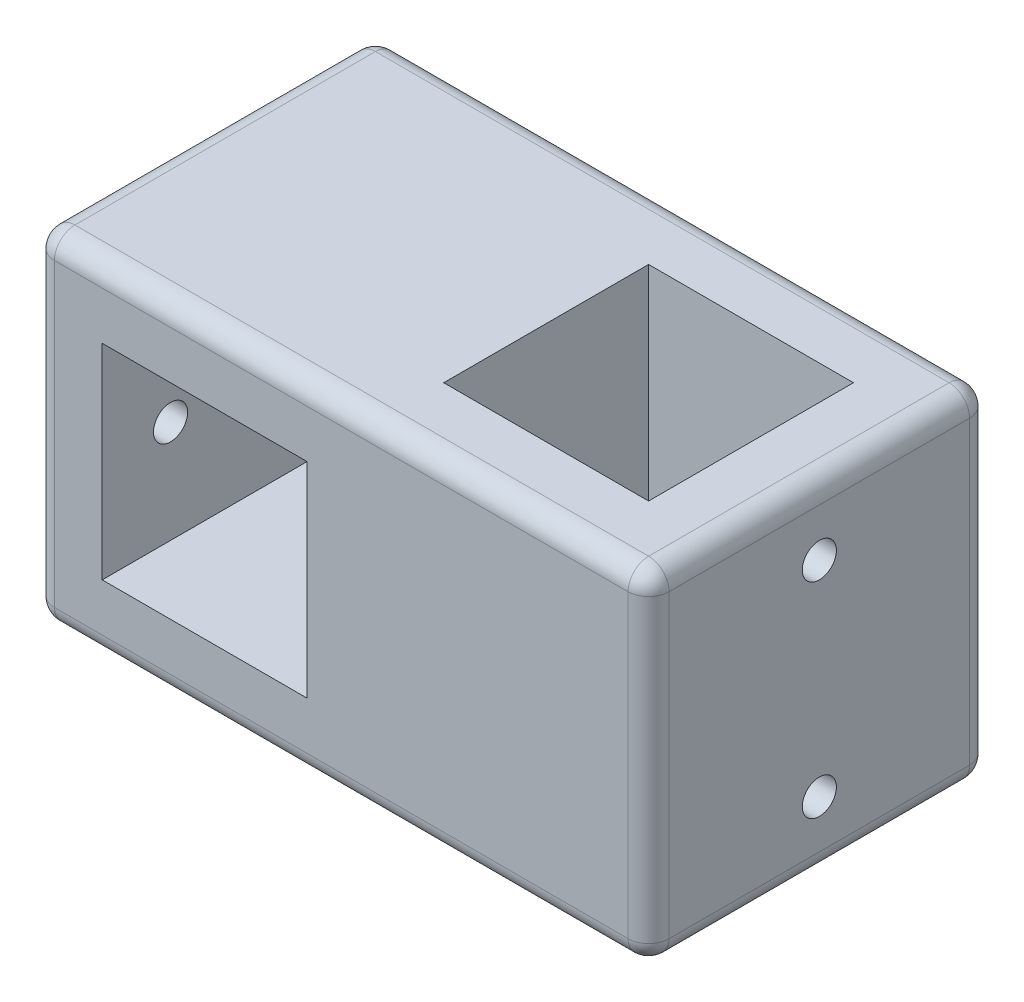
ISO-10303-21;
HEADER;
FILE_DESCRIPTION(('STEP AP214'),'2;1');
FILE_NAME('part.step','',(''),(''),'','','');
FILE_SCHEMA(('AUTOMOTIVE_DESIGN { 1 0 10303 214 1 1 1 1 }'));
ENDSEC;
DATA;
#1=APPLICATION_CONTEXT('core data for automotive mechanical design processes');
#2=APPLICATION_PROTOCOL_DEFINITION('international standard','automotive_design',2000,#1);
#3=PRODUCT_CONTEXT('',#1,'mechanical');
#4=PRODUCT('Part','Part','',(#3));
#5=PRODUCT_RELATED_PRODUCT_CATEGORY('part','',(#4));
#6=PRODUCT_DEFINITION_FORMATION('','',#4);
#7=PRODUCT_DEFINITION_CONTEXT('part definition',#1,'design');
#8=PRODUCT_DEFINITION('design','',#6,#7);
#9=PRODUCT_DEFINITION_SHAPE('','',#8);
#10=(LENGTH_UNIT() NAMED_UNIT(*) SI_UNIT(.MILLI.,.METRE.));
#11=(NAMED_UNIT(*) PLANE_ANGLE_UNIT() SI_UNIT($,.RADIAN.));
#12=(NAMED_UNIT(*) SI_UNIT($,.STERADIAN.) SOLID_ANGLE_UNIT());
#13=UNCERTAINTY_MEASURE_WITH_UNIT(LENGTH_MEASURE(1.E-05),#10,'distance_accuracy_value','');
#14=(GEOMETRIC_REPRESENTATION_CONTEXT(3) GLOBAL_UNCERTAINTY_ASSIGNED_CONTEXT((#13)) GLOBAL_UNIT_ASSIGNED_CONTEXT((#10,
#11,#12)) REPRESENTATION_CONTEXT('',''));
#15=CARTESIAN_POINT('',(0.,0.,0.));
#16=DIRECTION('',(0.,0.,1.));
#17=DIRECTION('',(1.,0.,0.));
#18=AXIS2_PLACEMENT_3D('',#15,#16,#17);
#19=CARTESIAN_POINT('',(-45.,-25.,50.));
#20=DIRECTION('',(1.,0.,0.));
#21=DIRECTION('',(0.,0.,-1.));
#22=AXIS2_PLACEMENT_3D('',#19,#20,#21);
#23=PLANE('',#22);
#24=CARTESIAN_POINT('',(-45.,0.,10.));
#25=DIRECTION('',(-1.,0.,0.));
#26=DIRECTION('',(0.,0.,1.));
#27=AXIS2_PLACEMENT_3D('',#24,#25,#26);
#28=CIRCLE('',#27,2.5);
#29=CARTESIAN_POINT('',(-45.,0.,12.5));
#30=VERTEX_POINT('',#29);
#31=EDGE_CURVE('E449',#30,#30,#28,.T.);
#32=ORIENTED_EDGE('',*,*,#31,.F.);
#33=EDGE_LOOP('',(#32));
#34=FACE_BOUND('',#33,.T.);
#35=CARTESIAN_POINT('',(-45.,0.,40.));
#36=DIRECTION('',(-1.,0.,0.));
#37=DIRECTION('',(0.,0.,1.));
#38=AXIS2_PLACEMENT_3D('',#35,#36,#37);
#39=CIRCLE('',#38,2.5);
#40=CARTESIAN_POINT('',(-45.,0.,42.5));
#41=VERTEX_POINT('',#40);
#42=EDGE_CURVE('E450',#41,#41,#39,.T.);
#43=ORIENTED_EDGE('',*,*,#42,.F.);
#44=EDGE_LOOP('',(#43));
#45=FACE_BOUND('',#44,.T.);
#46=DIRECTION('',(0.,0.,-1.));
#47=VECTOR('',#46,1.);
#48=CARTESIAN_POINT('',(-45.,-22.,50.));
#49=LINE('',#48,#47);
#50=CARTESIAN_POINT('',(-45.,-22.,3.));
#51=VERTEX_POINT('',#50);
#52=CARTESIAN_POINT('',(-45.,-22.,47.));
#53=VERTEX_POINT('',#52);
#54=EDGE_CURVE('E276',#51,#53,#49,.F.);
#55=ORIENTED_EDGE('',*,*,#54,.T.);
#56=DIRECTION('',(0.,-1.,0.));
#57=VECTOR('',#56,1.);
#58=CARTESIAN_POINT('',(-45.,25.,47.));
#59=LINE('',#58,#57);
#60=CARTESIAN_POINT('',(-45.,22.,47.));
#61=VERTEX_POINT('',#60);
#62=EDGE_CURVE('E283',#53,#61,#59,.F.);
#63=ORIENTED_EDGE('',*,*,#62,.T.);
#64=DIRECTION('',(0.,0.,-1.));
#65=VECTOR('',#64,1.);
#66=CARTESIAN_POINT('',(-45.,22.,50.));
#67=LINE('',#66,#65);
#68=CARTESIAN_POINT('',(-45.,22.,3.));
#69=VERTEX_POINT('',#68);
#70=EDGE_CURVE('E279',#61,#69,#67,.T.);
#71=ORIENTED_EDGE('',*,*,#70,.T.);
#72=DIRECTION('',(0.,-1.,0.));
#73=VECTOR('',#72,1.);
#74=CARTESIAN_POINT('',(-45.,-25.,3.));
#75=LINE('',#74,#73);
#76=EDGE_CURVE('E273',#69,#51,#75,.T.);
#77=ORIENTED_EDGE('',*,*,#76,.T.);
#78=EDGE_LOOP('',(#55,#63,#71,#77));
#79=FACE_BOUND('',#78,.T.);
#80=ADVANCED_FACE('F39',(#34,#45,#79),#23,.F.);
#81=CARTESIAN_POINT('',(45.,-25.,50.));
#82=DIRECTION('',(0.,1.,0.));
#83=DIRECTION('',(-1.,0.,0.));
#84=AXIS2_PLACEMENT_3D('',#81,#82,#83);
#85=PLANE('',#84);
#86=DIRECTION('',(1.,0.,0.));
#87=VECTOR('',#86,1.);
#88=CARTESIAN_POINT('',(-45.,-25.,47.));
#89=LINE('',#88,#87);
#90=CARTESIAN_POINT('',(42.,-25.,47.));
#91=VERTEX_POINT('',#90);
#92=CARTESIAN_POINT('',(-42.,-25.,47.));
#93=VERTEX_POINT('',#92);
#94=EDGE_CURVE('E302',#91,#93,#89,.F.);
#95=ORIENTED_EDGE('',*,*,#94,.T.);
#96=DIRECTION('',(0.,0.,-1.));
#97=VECTOR('',#96,1.);
#98=CARTESIAN_POINT('',(-42.,-25.,50.));
#99=LINE('',#98,#97);
#100=CARTESIAN_POINT('',(-42.,-25.,3.));
#101=VERTEX_POINT('',#100);
#102=EDGE_CURVE('E308',#93,#101,#99,.T.);
#103=ORIENTED_EDGE('',*,*,#102,.T.);
#104=DIRECTION('',(1.,0.,0.));
#105=VECTOR('',#104,1.);
#106=CARTESIAN_POINT('',(45.,-25.,3.));
#107=LINE('',#106,#105);
#108=CARTESIAN_POINT('',(42.,-25.,3.));
#109=VERTEX_POINT('',#108);
#110=EDGE_CURVE('E305',#101,#109,#107,.T.);
#111=ORIENTED_EDGE('',*,*,#110,.T.);
#112=DIRECTION('',(0.,0.,-1.));
#113=VECTOR('',#112,1.);
#114=CARTESIAN_POINT('',(42.,-25.,50.));
#115=LINE('',#114,#113);
#116=EDGE_CURVE('E299',#109,#91,#115,.F.);
#117=ORIENTED_EDGE('',*,*,#116,.T.);
#118=EDGE_LOOP('',(#95,#103,#111,#117));
#119=FACE_BOUND('',#118,.T.);
#120=DIRECTION('',(1.,0.,0.));
#121=VECTOR('',#120,1.);
#122=CARTESIAN_POINT('',(35.,-25.,9.99999999999999));
#123=LINE('',#122,#121);
#124=CARTESIAN_POINT('',(5.,-25.,10.));
#125=VERTEX_POINT('',#124);
#126=CARTESIAN_POINT('',(35.,-25.,9.99999999999999));
#127=VERTEX_POINT('',#126);
#128=EDGE_CURVE('E204',#125,#127,#123,.T.);
#129=ORIENTED_EDGE('',*,*,#128,.F.);
#130=DIRECTION('',(0.,0.,-1.));
#131=VECTOR('',#130,1.);
#132=CARTESIAN_POINT('',(5.,-25.,10.));
#133=LINE('',#132,#131);
#134=CARTESIAN_POINT('',(5.,-25.,40.));
#135=VERTEX_POINT('',#134);
#136=EDGE_CURVE('E181',#135,#125,#133,.T.);
#137=ORIENTED_EDGE('',*,*,#136,.F.);
#138=DIRECTION('',(-1.,0.,0.));
#139=VECTOR('',#138,1.);
#140=CARTESIAN_POINT('',(35.,-25.,40.));
#141=LINE('',#140,#139);
#142=CARTESIAN_POINT('',(35.,-25.,40.));
#143=VERTEX_POINT('',#142);
#144=EDGE_CURVE('E194',#143,#135,#141,.T.);
#145=ORIENTED_EDGE('',*,*,#144,.F.);
#146=DIRECTION('',(0.,0.,1.));
#147=VECTOR('',#146,1.);
#148=CARTESIAN_POINT('',(35.,-25.,9.99999999999999));
#149=LINE('',#148,#147);
#150=EDGE_CURVE('E211',#127,#143,#149,.T.);
#151=ORIENTED_EDGE('',*,*,#150,.F.);
#152=EDGE_LOOP('',(#129,#137,#145,#151));
#153=FACE_BOUND('',#152,.T.);
#154=ADVANCED_FACE('F202',(#119,#153),#85,.F.);
#155=CARTESIAN_POINT('',(45.,-25.,50.));
#156=DIRECTION('',(-1.,0.,0.));
#157=DIRECTION('',(0.,0.,1.));
#158=AXIS2_PLACEMENT_3D('',#155,#156,#157);
#159=PLANE('',#158);
#160=CARTESIAN_POINT('',(45.,15.,25.));
#161=DIRECTION('',(1.,0.,0.));
#162=DIRECTION('',(0.,0.,-1.));
#163=AXIS2_PLACEMENT_3D('',#160,#161,#162);
#164=CIRCLE('',#163,2.5);
#165=CARTESIAN_POINT('',(45.,15.,22.5));
#166=VERTEX_POINT('',#165);
#167=EDGE_CURVE('E454',#166,#166,#164,.T.);
#168=ORIENTED_EDGE('',*,*,#167,.F.);
#169=EDGE_LOOP('',(#168));
#170=FACE_BOUND('',#169,.T.);
#171=CARTESIAN_POINT('',(45.,-15.,25.));
#172=DIRECTION('',(1.,0.,0.));
#173=DIRECTION('',(0.,0.,-1.));
#174=AXIS2_PLACEMENT_3D('',#171,#172,#173);
#175=CIRCLE('',#174,2.5);
#176=CARTESIAN_POINT('',(45.,-15.,22.5));
#177=VERTEX_POINT('',#176);
#178=EDGE_CURVE('E461',#177,#177,#175,.T.);
#179=ORIENTED_EDGE('',*,*,#178,.F.);
#180=EDGE_LOOP('',(#179));
#181=FACE_BOUND('',#180,.T.);
#182=DIRECTION('',(0.,0.,-1.));
#183=VECTOR('',#182,1.);
#184=CARTESIAN_POINT('',(45.,-22.,50.));
#185=LINE('',#184,#183);
#186=CARTESIAN_POINT('',(45.,-22.,47.));
#187=VERTEX_POINT('',#186);
#188=CARTESIAN_POINT('',(45.,-22.,3.));
#189=VERTEX_POINT('',#188);
#190=EDGE_CURVE('E49',#187,#189,#185,.T.);
#191=ORIENTED_EDGE('',*,*,#190,.T.);
#192=DIRECTION('',(0.,1.,0.));
#193=VECTOR('',#192,1.);
#194=CARTESIAN_POINT('',(45.,-25.,3.));
#195=LINE('',#194,#193);
#196=CARTESIAN_POINT('',(45.,22.,3.));
#197=VERTEX_POINT('',#196);
#198=EDGE_CURVE('E11',#189,#197,#195,.T.);
#199=ORIENTED_EDGE('',*,*,#198,.T.);
#200=DIRECTION('',(0.,0.,-1.));
#201=VECTOR('',#200,1.);
#202=CARTESIAN_POINT('',(45.,22.,50.));
#203=LINE('',#202,#201);
#204=CARTESIAN_POINT('',(45.,22.,47.));
#205=VERTEX_POINT('',#204);
#206=EDGE_CURVE('E341',#197,#205,#203,.F.);
#207=ORIENTED_EDGE('',*,*,#206,.T.);
#208=DIRECTION('',(0.,1.,0.));
#209=VECTOR('',#208,1.);
#210=CARTESIAN_POINT('',(45.,-25.,47.));
#211=LINE('',#210,#209);
#212=EDGE_CURVE('E338',#205,#187,#211,.F.);
#213=ORIENTED_EDGE('',*,*,#212,.T.);
#214=EDGE_LOOP('',(#191,#199,#207,#213));
#215=FACE_BOUND('',#214,.T.);
#216=ADVANCED_FACE('F506',(#170,#181,#215),#159,.F.);
#217=CARTESIAN_POINT('',(45.,25.,50.));
#218=DIRECTION('',(0.,-1.,0.));
#219=DIRECTION('',(1.,0.,0.));
#220=AXIS2_PLACEMENT_3D('',#217,#218,#219);
#221=PLANE('',#220);
#222=DIRECTION('',(0.,0.,-1.));
#223=VECTOR('',#222,1.);
#224=CARTESIAN_POINT('',(-42.,25.,50.));
#225=LINE('',#224,#223);
#226=CARTESIAN_POINT('',(-42.,25.,3.));
#227=VERTEX_POINT('',#226);
#228=CARTESIAN_POINT('',(-42.,25.,47.));
#229=VERTEX_POINT('',#228);
#230=EDGE_CURVE('E292',#227,#229,#225,.F.);
#231=ORIENTED_EDGE('',*,*,#230,.T.);
#232=DIRECTION('',(-1.,0.,0.));
#233=VECTOR('',#232,1.);
#234=CARTESIAN_POINT('',(45.,25.,47.));
#235=LINE('',#234,#233);
#236=CARTESIAN_POINT('',(42.,25.,47.));
#237=VERTEX_POINT('',#236);
#238=EDGE_CURVE('E296',#229,#237,#235,.F.);
#239=ORIENTED_EDGE('',*,*,#238,.T.);
#240=DIRECTION('',(0.,0.,-1.));
#241=VECTOR('',#240,1.);
#242=CARTESIAN_POINT('',(42.,25.,50.));
#243=LINE('',#242,#241);
#244=CARTESIAN_POINT('',(42.,25.,3.));
#245=VERTEX_POINT('',#244);
#246=EDGE_CURVE('E289',#237,#245,#243,.T.);
#247=ORIENTED_EDGE('',*,*,#246,.T.);
#248=DIRECTION('',(-1.,0.,0.));
#249=VECTOR('',#248,1.);
#250=CARTESIAN_POINT('',(45.,25.,3.));
#251=LINE('',#250,#249);
#252=EDGE_CURVE('E286',#245,#227,#251,.T.);
#253=ORIENTED_EDGE('',*,*,#252,.T.);
#254=EDGE_LOOP('',(#231,#239,#247,#253));
#255=FACE_BOUND('',#254,.T.);
#256=DIRECTION('',(1.,0.,0.));
#257=VECTOR('',#256,1.);
#258=CARTESIAN_POINT('',(35.,25.,40.));
#259=LINE('',#258,#257);
#260=CARTESIAN_POINT('',(5.,25.,40.));
#261=VERTEX_POINT('',#260);
#262=CARTESIAN_POINT('',(35.,25.,40.));
#263=VERTEX_POINT('',#262);
#264=EDGE_CURVE('E209',#261,#263,#259,.T.);
#265=ORIENTED_EDGE('',*,*,#264,.F.);
#266=DIRECTION('',(0.,0.,1.));
#267=VECTOR('',#266,1.);
#268=CARTESIAN_POINT('',(4.99999999999999,25.,10.));
#269=LINE('',#268,#267);
#270=CARTESIAN_POINT('',(4.99999999999999,25.,10.));
#271=VERTEX_POINT('',#270);
#272=EDGE_CURVE('E184',#271,#261,#269,.T.);
#273=ORIENTED_EDGE('',*,*,#272,.F.);
#274=DIRECTION('',(-1.,0.,0.));
#275=VECTOR('',#274,1.);
#276=CARTESIAN_POINT('',(35.,25.,9.99999999999999));
#277=LINE('',#276,#275);
#278=CARTESIAN_POINT('',(35.,25.,9.99999999999999));
#279=VERTEX_POINT('',#278);
#280=EDGE_CURVE('E190',#279,#271,#277,.T.);
#281=ORIENTED_EDGE('',*,*,#280,.F.);
#282=DIRECTION('',(0.,0.,-1.));
#283=VECTOR('',#282,1.);
#284=CARTESIAN_POINT('',(35.,25.,9.99999999999999));
#285=LINE('',#284,#283);
#286=EDGE_CURVE('E217',#263,#279,#285,.T.);
#287=ORIENTED_EDGE('',*,*,#286,.F.);
#288=EDGE_LOOP('',(#265,#273,#281,#287));
#289=FACE_BOUND('',#288,.T.);
#290=ADVANCED_FACE('F632',(#255,#289),#221,.F.);
#291=CARTESIAN_POINT('',(0.,0.,50.));
#292=DIRECTION('',(0.,0.,1.));
#293=DIRECTION('',(1.,0.,0.));
#294=AXIS2_PLACEMENT_3D('',#291,#292,#293);
#295=PLANE('',#294);
#296=DIRECTION('',(-1.,0.,0.));
#297=VECTOR('',#296,1.);
#298=CARTESIAN_POINT('',(-45.,22.,50.));
#299=LINE('',#298,#297);
#300=CARTESIAN_POINT('',(42.,22.,50.));
#301=VERTEX_POINT('',#300);
#302=CARTESIAN_POINT('',(-42.,22.,50.));
#303=VERTEX_POINT('',#302);
#304=EDGE_CURVE('E328',#301,#303,#299,.T.);
#305=ORIENTED_EDGE('',*,*,#304,.T.);
#306=DIRECTION('',(0.,-1.,0.));
#307=VECTOR('',#306,1.);
#308=CARTESIAN_POINT('',(-42.,-25.,50.));
#309=LINE('',#308,#307);
#310=CARTESIAN_POINT('',(-42.,-22.,50.));
#311=VERTEX_POINT('',#310);
#312=EDGE_CURVE('E335',#303,#311,#309,.T.);
#313=ORIENTED_EDGE('',*,*,#312,.T.);
#314=DIRECTION('',(1.,0.,0.));
#315=VECTOR('',#314,1.);
#316=CARTESIAN_POINT('',(45.,-22.,50.));
#317=LINE('',#316,#315);
#318=CARTESIAN_POINT('',(42.,-22.,50.));
#319=VERTEX_POINT('',#318);
#320=EDGE_CURVE('E331',#311,#319,#317,.T.);
#321=ORIENTED_EDGE('',*,*,#320,.T.);
#322=DIRECTION('',(0.,1.,0.));
#323=VECTOR('',#322,1.);
#324=CARTESIAN_POINT('',(42.,25.,50.));
#325=LINE('',#324,#323);
#326=EDGE_CURVE('E325',#319,#301,#325,.T.);
#327=ORIENTED_EDGE('',*,*,#326,.T.);
#328=EDGE_LOOP('',(#305,#313,#321,#327));
#329=FACE_BOUND('',#328,.T.);
#330=DIRECTION('',(0.,-1.,0.));
#331=VECTOR('',#330,1.);
#332=CARTESIAN_POINT('',(-35.,-15.,50.));
#333=LINE('',#332,#331);
#334=CARTESIAN_POINT('',(-35.,15.,50.));
#335=VERTEX_POINT('',#334);
#336=CARTESIAN_POINT('',(-35.,-15.,50.));
#337=VERTEX_POINT('',#336);
#338=EDGE_CURVE('E241',#335,#337,#333,.T.);
#339=ORIENTED_EDGE('',*,*,#338,.F.);
#340=DIRECTION('',(-1.,0.,0.));
#341=VECTOR('',#340,1.);
#342=CARTESIAN_POINT('',(-5.,15.,50.));
#343=LINE('',#342,#341);
#344=CARTESIAN_POINT('',(-5.,15.,50.));
#345=VERTEX_POINT('',#344);
#346=EDGE_CURVE('E252',#345,#335,#343,.T.);
#347=ORIENTED_EDGE('',*,*,#346,.F.);
#348=DIRECTION('',(0.,1.,0.));
#349=VECTOR('',#348,1.);
#350=CARTESIAN_POINT('',(-5.,-15.,50.));
#351=LINE('',#350,#349);
#352=CARTESIAN_POINT('',(-5.,-15.,50.));
#353=VERTEX_POINT('',#352);
#354=EDGE_CURVE('E248',#353,#345,#351,.T.);
#355=ORIENTED_EDGE('',*,*,#354,.F.);
#356=DIRECTION('',(1.,0.,0.));
#357=VECTOR('',#356,1.);
#358=CARTESIAN_POINT('',(-5.,-15.,50.));
#359=LINE('',#358,#357);
#360=EDGE_CURVE('E244',#337,#353,#359,.T.);
#361=ORIENTED_EDGE('',*,*,#360,.F.);
#362=EDGE_LOOP('',(#339,#347,#355,#361));
#363=FACE_BOUND('',#362,.T.);
#364=ADVANCED_FACE('F613',(#329,#363),#295,.T.);
#365=CARTESIAN_POINT('',(0.,0.,0.));
#366=DIRECTION('',(0.,0.,1.));
#367=DIRECTION('',(1.,0.,0.));
#368=AXIS2_PLACEMENT_3D('',#365,#366,#367);
#369=PLANE('',#368);
#370=DIRECTION('',(1.,0.,0.));
#371=VECTOR('',#370,1.);
#372=CARTESIAN_POINT('',(0.,-22.,0.));
#373=LINE('',#372,#371);
#374=CARTESIAN_POINT('',(42.,-22.,0.));
#375=VERTEX_POINT('',#374);
#376=CARTESIAN_POINT('',(-42.,-22.,0.));
#377=VERTEX_POINT('',#376);
#378=EDGE_CURVE('E318',#375,#377,#373,.F.);
#379=ORIENTED_EDGE('',*,*,#378,.T.);
#380=DIRECTION('',(0.,-1.,0.));
#381=VECTOR('',#380,1.);
#382=CARTESIAN_POINT('',(-42.,0.,0.));
#383=LINE('',#382,#381);
#384=CARTESIAN_POINT('',(-42.,22.,0.));
#385=VERTEX_POINT('',#384);
#386=EDGE_CURVE('E322',#377,#385,#383,.F.);
#387=ORIENTED_EDGE('',*,*,#386,.T.);
#388=DIRECTION('',(-1.,0.,0.));
#389=VECTOR('',#388,1.);
#390=CARTESIAN_POINT('',(0.,22.,0.));
#391=LINE('',#390,#389);
#392=CARTESIAN_POINT('',(42.,22.,0.));
#393=VERTEX_POINT('',#392);
#394=EDGE_CURVE('E315',#385,#393,#391,.F.);
#395=ORIENTED_EDGE('',*,*,#394,.T.);
#396=DIRECTION('',(0.,1.,0.));
#397=VECTOR('',#396,1.);
#398=CARTESIAN_POINT('',(42.,0.,0.));
#399=LINE('',#398,#397);
#400=EDGE_CURVE('E312',#393,#375,#399,.F.);
#401=ORIENTED_EDGE('',*,*,#400,.T.);
#402=EDGE_LOOP('',(#379,#387,#395,#401));
#403=FACE_BOUND('',#402,.T.);
#404=DIRECTION('',(1.,0.,0.));
#405=VECTOR('',#404,1.);
#406=CARTESIAN_POINT('',(-5.,15.,0.));
#407=LINE('',#406,#405);
#408=CARTESIAN_POINT('',(-35.,15.,0.));
#409=VERTEX_POINT('',#408);
#410=CARTESIAN_POINT('',(-5.,15.,0.));
#411=VERTEX_POINT('',#410);
#412=EDGE_CURVE('E233',#409,#411,#407,.T.);
#413=ORIENTED_EDGE('',*,*,#412,.F.);
#414=DIRECTION('',(0.,1.,0.));
#415=VECTOR('',#414,1.);
#416=CARTESIAN_POINT('',(-35.,-15.,0.));
#417=LINE('',#416,#415);
#418=CARTESIAN_POINT('',(-35.,-15.,0.));
#419=VERTEX_POINT('',#418);
#420=EDGE_CURVE('E237',#419,#409,#417,.T.);
#421=ORIENTED_EDGE('',*,*,#420,.F.);
#422=DIRECTION('',(-1.,0.,0.));
#423=VECTOR('',#422,1.);
#424=CARTESIAN_POINT('',(-5.,-15.,0.));
#425=LINE('',#424,#423);
#426=CARTESIAN_POINT('',(-5.,-15.,0.));
#427=VERTEX_POINT('',#426);
#428=EDGE_CURVE('E260',#427,#419,#425,.T.);
#429=ORIENTED_EDGE('',*,*,#428,.F.);
#430=DIRECTION('',(0.,-1.,0.));
#431=VECTOR('',#430,1.);
#432=CARTESIAN_POINT('',(-5.,-15.,0.));
#433=LINE('',#432,#431);
#434=EDGE_CURVE('E199',#411,#427,#433,.T.);
#435=ORIENTED_EDGE('',*,*,#434,.F.);
#436=EDGE_LOOP('',(#413,#421,#429,#435));
#437=FACE_BOUND('',#436,.T.);
#438=ADVANCED_FACE('F624',(#403,#437),#369,.F.);
#439=CARTESIAN_POINT('',(-35.,-15.,-0.001000000000001));
#440=DIRECTION('',(-1.,0.,0.));
#441=DIRECTION('',(0.,0.,1.));
#442=AXIS2_PLACEMENT_3D('',#439,#440,#441);
#443=PLANE('',#442);
#444=CARTESIAN_POINT('',(-35.,0.,10.));
#445=DIRECTION('',(-1.,0.,0.));
#446=DIRECTION('',(0.,0.,1.));
#447=AXIS2_PLACEMENT_3D('',#444,#445,#446);
#448=CIRCLE('',#447,2.5);
#449=CARTESIAN_POINT('',(-35.,0.,12.5));
#450=VERTEX_POINT('',#449);
#451=EDGE_CURVE('E350',#450,#450,#448,.F.);
#452=ORIENTED_EDGE('',*,*,#451,.F.);
#453=EDGE_LOOP('',(#452));
#454=FACE_BOUND('',#453,.T.);
#455=CARTESIAN_POINT('',(-35.,0.,40.));
#456=DIRECTION('',(-1.,0.,0.));
#457=DIRECTION('',(0.,0.,1.));
#458=AXIS2_PLACEMENT_3D('',#455,#456,#457);
#459=CIRCLE('',#458,2.5);
#460=CARTESIAN_POINT('',(-35.,0.,42.5));
#461=VERTEX_POINT('',#460);
#462=EDGE_CURVE('E445',#461,#461,#459,.F.);
#463=ORIENTED_EDGE('',*,*,#462,.F.);
#464=EDGE_LOOP('',(#463));
#465=FACE_BOUND('',#464,.T.);
#466=ORIENTED_EDGE('',*,*,#420,.T.);
#467=DIRECTION('',(0.,0.,1.));
#468=VECTOR('',#467,1.);
#469=CARTESIAN_POINT('',(-35.,15.,-0.001000000000001));
#470=LINE('',#469,#468);
#471=EDGE_CURVE('E257',#409,#335,#470,.T.);
#472=ORIENTED_EDGE('',*,*,#471,.T.);
#473=ORIENTED_EDGE('',*,*,#338,.T.);
#474=DIRECTION('',(0.,0.,1.));
#475=VECTOR('',#474,1.);
#476=CARTESIAN_POINT('',(-35.,-15.,-0.001000000000001));
#477=LINE('',#476,#475);
#478=EDGE_CURVE('E256',#419,#337,#477,.T.);
#479=ORIENTED_EDGE('',*,*,#478,.F.);
#480=EDGE_LOOP('',(#466,#472,#473,#479));
#481=FACE_BOUND('',#480,.T.);
#482=ADVANCED_FACE('F655',(#454,#465,#481),#443,.F.);
#483=CARTESIAN_POINT('',(-5.,15.,-0.001000000000001));
#484=DIRECTION('',(0.,1.,0.));
#485=DIRECTION('',(-1.,0.,0.));
#486=AXIS2_PLACEMENT_3D('',#483,#484,#485);
#487=PLANE('',#486);
#488=ORIENTED_EDGE('',*,*,#412,.T.);
#489=DIRECTION('',(0.,0.,1.));
#490=VECTOR('',#489,1.);
#491=CARTESIAN_POINT('',(-5.,15.,-0.001000000000001));
#492=LINE('',#491,#490);
#493=EDGE_CURVE('E261',#411,#345,#492,.T.);
#494=ORIENTED_EDGE('',*,*,#493,.T.);
#495=ORIENTED_EDGE('',*,*,#346,.T.);
#496=ORIENTED_EDGE('',*,*,#471,.F.);
#497=EDGE_LOOP('',(#488,#494,#495,#496));
#498=FACE_BOUND('',#497,.T.);
#499=ADVANCED_FACE('F651',(#498),#487,.F.);
#500=CARTESIAN_POINT('',(-5.,-15.,-0.001000000000001));
#501=DIRECTION('',(1.,0.,0.));
#502=DIRECTION('',(0.,0.,-1.));
#503=AXIS2_PLACEMENT_3D('',#500,#501,#502);
#504=PLANE('',#503);
#505=ORIENTED_EDGE('',*,*,#434,.T.);
#506=DIRECTION('',(0.,0.,1.));
#507=VECTOR('',#506,1.);
#508=CARTESIAN_POINT('',(-5.,-15.,-0.001000000000001));
#509=LINE('',#508,#507);
#510=EDGE_CURVE('E264',#427,#353,#509,.T.);
#511=ORIENTED_EDGE('',*,*,#510,.T.);
#512=ORIENTED_EDGE('',*,*,#354,.T.);
#513=ORIENTED_EDGE('',*,*,#493,.F.);
#514=EDGE_LOOP('',(#505,#511,#512,#513));
#515=FACE_BOUND('',#514,.T.);
#516=ADVANCED_FACE('F654',(#515),#504,.F.);
#517=CARTESIAN_POINT('',(-5.,-15.,-0.001000000000001));
#518=DIRECTION('',(0.,-1.,0.));
#519=DIRECTION('',(1.,0.,0.));
#520=AXIS2_PLACEMENT_3D('',#517,#518,#519);
#521=PLANE('',#520);
#522=ORIENTED_EDGE('',*,*,#428,.T.);
#523=ORIENTED_EDGE('',*,*,#478,.T.);
#524=ORIENTED_EDGE('',*,*,#360,.T.);
#525=ORIENTED_EDGE('',*,*,#510,.F.);
#526=EDGE_LOOP('',(#522,#523,#524,#525));
#527=FACE_BOUND('',#526,.T.);
#528=ADVANCED_FACE('F645',(#527),#521,.F.);
#529=CARTESIAN_POINT('',(5.,-25.001,10.));
#530=DIRECTION('',(-1.,0.,0.));
#531=DIRECTION('',(0.,-1.,0.));
#532=AXIS2_PLACEMENT_3D('',#529,#530,#531);
#533=PLANE('',#532);
#534=ORIENTED_EDGE('',*,*,#136,.T.);
#535=DIRECTION('',(0.,1.,0.));
#536=VECTOR('',#535,1.);
#537=CARTESIAN_POINT('',(5.,-25.001,10.));
#538=LINE('',#537,#536);
#539=EDGE_CURVE('E200',#125,#271,#538,.T.);
#540=ORIENTED_EDGE('',*,*,#539,.T.);
#541=ORIENTED_EDGE('',*,*,#272,.T.);
#542=DIRECTION('',(0.,1.,0.));
#543=VECTOR('',#542,1.);
#544=CARTESIAN_POINT('',(5.00000000000001,-25.001,40.));
#545=LINE('',#544,#543);
#546=EDGE_CURVE('E177',#135,#261,#545,.T.);
#547=ORIENTED_EDGE('',*,*,#546,.F.);
#548=EDGE_LOOP('',(#534,#540,#541,#547));
#549=FACE_BOUND('',#548,.T.);
#550=ADVANCED_FACE('F179',(#549),#533,.F.);
#551=CARTESIAN_POINT('',(35.,-25.001,9.99999999999999));
#552=DIRECTION('',(0.,0.,-1.));
#553=DIRECTION('',(-1.,0.,0.));
#554=AXIS2_PLACEMENT_3D('',#551,#552,#553);
#555=PLANE('',#554);
#556=ORIENTED_EDGE('',*,*,#128,.T.);
#557=DIRECTION('',(0.,1.,0.));
#558=VECTOR('',#557,1.);
#559=CARTESIAN_POINT('',(35.,-25.001,9.99999999999999));
#560=LINE('',#559,#558);
#561=EDGE_CURVE('E226',#127,#279,#560,.T.);
#562=ORIENTED_EDGE('',*,*,#561,.T.);
#563=ORIENTED_EDGE('',*,*,#280,.T.);
#564=ORIENTED_EDGE('',*,*,#539,.F.);
#565=EDGE_LOOP('',(#556,#562,#563,#564));
#566=FACE_BOUND('',#565,.T.);
#567=ADVANCED_FACE('F482',(#566),#555,.F.);
#568=CARTESIAN_POINT('',(35.,-25.001,9.99999999999999));
#569=DIRECTION('',(1.,0.,0.));
#570=DIRECTION('',(0.,0.,-1.));
#571=AXIS2_PLACEMENT_3D('',#568,#569,#570);
#572=PLANE('',#571);
#573=CARTESIAN_POINT('',(35.,15.,25.));
#574=DIRECTION('',(1.,0.,0.));
#575=DIRECTION('',(0.,0.,-1.));
#576=AXIS2_PLACEMENT_3D('',#573,#574,#575);
#577=CIRCLE('',#576,2.5);
#578=CARTESIAN_POINT('',(35.,15.,22.5));
#579=VERTEX_POINT('',#578);
#580=EDGE_CURVE('E465',#579,#579,#577,.F.);
#581=ORIENTED_EDGE('',*,*,#580,.F.);
#582=EDGE_LOOP('',(#581));
#583=FACE_BOUND('',#582,.T.);
#584=CARTESIAN_POINT('',(35.,-15.,25.));
#585=DIRECTION('',(1.,0.,0.));
#586=DIRECTION('',(0.,0.,-1.));
#587=AXIS2_PLACEMENT_3D('',#584,#585,#586);
#588=CIRCLE('',#587,2.5);
#589=CARTESIAN_POINT('',(35.,-15.,22.5));
#590=VERTEX_POINT('',#589);
#591=EDGE_CURVE('E466',#590,#590,#588,.F.);
#592=ORIENTED_EDGE('',*,*,#591,.F.);
#593=EDGE_LOOP('',(#592));
#594=FACE_BOUND('',#593,.T.);
#595=ORIENTED_EDGE('',*,*,#150,.T.);
#596=DIRECTION('',(0.,1.,0.));
#597=VECTOR('',#596,1.);
#598=CARTESIAN_POINT('',(35.,-25.001,40.));
#599=LINE('',#598,#597);
#600=EDGE_CURVE('E189',#143,#263,#599,.T.);
#601=ORIENTED_EDGE('',*,*,#600,.T.);
#602=ORIENTED_EDGE('',*,*,#286,.T.);
#603=ORIENTED_EDGE('',*,*,#561,.F.);
#604=EDGE_LOOP('',(#595,#601,#602,#603));
#605=FACE_BOUND('',#604,.T.);
#606=ADVANCED_FACE('F479',(#583,#594,#605),#572,.F.);
#607=CARTESIAN_POINT('',(35.,-25.001,40.));
#608=DIRECTION('',(0.,0.,1.));
#609=DIRECTION('',(1.,0.,0.));
#610=AXIS2_PLACEMENT_3D('',#607,#608,#609);
#611=PLANE('',#610);
#612=ORIENTED_EDGE('',*,*,#144,.T.);
#613=ORIENTED_EDGE('',*,*,#546,.T.);
#614=ORIENTED_EDGE('',*,*,#264,.T.);
#615=ORIENTED_EDGE('',*,*,#600,.F.);
#616=EDGE_LOOP('',(#612,#613,#614,#615));
#617=FACE_BOUND('',#616,.T.);
#618=ADVANCED_FACE('F195',(#617),#611,.F.);
#619=CARTESIAN_POINT('',(42.,-22.,50.));
#620=DIRECTION('',(0.,0.,-1.));
#621=DIRECTION('',(-1.,0.,0.));
#622=AXIS2_PLACEMENT_3D('',#619,#620,#621);
#623=CYLINDRICAL_SURFACE('',#622,3.);
#624=CARTESIAN_POINT('',(42.,-22.,47.));
#625=DIRECTION('',(0.,0.,1.));
#626=DIRECTION('',(1.,0.,0.));
#627=AXIS2_PLACEMENT_3D('',#624,#625,#626);
#628=CIRCLE('',#627,3.);
#629=EDGE_CURVE('E43',#91,#187,#628,.T.);
#630=ORIENTED_EDGE('',*,*,#629,.F.);
#631=ORIENTED_EDGE('',*,*,#116,.F.);
#632=CARTESIAN_POINT('',(42.,-22.,3.));
#633=DIRECTION('',(0.,0.,-1.));
#634=DIRECTION('',(-1.,0.,0.));
#635=AXIS2_PLACEMENT_3D('',#632,#633,#634);
#636=CIRCLE('',#635,3.);
#637=EDGE_CURVE('E430',#189,#109,#636,.T.);
#638=ORIENTED_EDGE('',*,*,#637,.F.);
#639=ORIENTED_EDGE('',*,*,#190,.F.);
#640=EDGE_LOOP('',(#630,#631,#638,#639));
#641=FACE_BOUND('',#640,.T.);
#642=ADVANCED_FACE('F41',(#641),#623,.T.);
#643=CARTESIAN_POINT('',(42.,-22.,47.));
#644=DIRECTION('',(0.,0.,1.));
#645=DIRECTION('',(1.,0.,0.));
#646=AXIS2_PLACEMENT_3D('',#643,#644,#645);
#647=SPHERICAL_SURFACE('',#646,3.);
#648=CARTESIAN_POINT('',(42.,-22.,47.));
#649=DIRECTION('',(1.,0.,0.));
#650=DIRECTION('',(0.,0.,-1.));
#651=AXIS2_PLACEMENT_3D('',#648,#649,#650);
#652=CIRCLE('',#651,3.);
#653=EDGE_CURVE('E423',#91,#319,#652,.F.);
#654=ORIENTED_EDGE('',*,*,#653,.F.);
#655=ORIENTED_EDGE('',*,*,#629,.T.);
#656=CARTESIAN_POINT('',(42.,-22.,47.));
#657=DIRECTION('',(0.,-1.,0.));
#658=DIRECTION('',(0.,0.,-1.));
#659=AXIS2_PLACEMENT_3D('',#656,#657,#658);
#660=CIRCLE('',#659,3.);
#661=EDGE_CURVE('E427',#319,#187,#660,.F.);
#662=ORIENTED_EDGE('',*,*,#661,.F.);
#663=EDGE_LOOP('',(#654,#655,#662));
#664=FACE_BOUND('',#663,.T.);
#665=ADVANCED_FACE('F582',(#664),#647,.T.);
#666=CARTESIAN_POINT('',(42.,-22.,3.));
#667=DIRECTION('',(0.,0.,1.));
#668=DIRECTION('',(1.,0.,0.));
#669=AXIS2_PLACEMENT_3D('',#666,#667,#668);
#670=SPHERICAL_SURFACE('',#669,3.);
#671=CARTESIAN_POINT('',(42.,-22.,3.));
#672=DIRECTION('',(0.,-1.,0.));
#673=DIRECTION('',(0.,0.,-1.));
#674=AXIS2_PLACEMENT_3D('',#671,#672,#673);
#675=CIRCLE('',#674,3.);
#676=EDGE_CURVE('E416',#189,#375,#675,.F.);
#677=ORIENTED_EDGE('',*,*,#676,.F.);
#678=ORIENTED_EDGE('',*,*,#637,.T.);
#679=CARTESIAN_POINT('',(42.,-22.,3.));
#680=DIRECTION('',(1.,0.,0.));
#681=DIRECTION('',(0.,0.,-1.));
#682=AXIS2_PLACEMENT_3D('',#679,#680,#681);
#683=CIRCLE('',#682,3.);
#684=EDGE_CURVE('E419',#375,#109,#683,.F.);
#685=ORIENTED_EDGE('',*,*,#684,.F.);
#686=EDGE_LOOP('',(#677,#678,#685));
#687=FACE_BOUND('',#686,.T.);
#688=ADVANCED_FACE('F579',(#687),#670,.T.);
#689=CARTESIAN_POINT('',(42.,0.,47.));
#690=DIRECTION('',(0.,-1.,0.));
#691=DIRECTION('',(0.,0.,-1.));
#692=AXIS2_PLACEMENT_3D('',#689,#690,#691);
#693=CYLINDRICAL_SURFACE('',#692,3.);
#694=ORIENTED_EDGE('',*,*,#661,.T.);
#695=ORIENTED_EDGE('',*,*,#212,.F.);
#696=CARTESIAN_POINT('',(42.,22.,47.));
#697=DIRECTION('',(0.,1.,0.));
#698=DIRECTION('',(0.,0.,1.));
#699=AXIS2_PLACEMENT_3D('',#696,#697,#698);
#700=CIRCLE('',#699,3.);
#701=EDGE_CURVE('E408',#301,#205,#700,.T.);
#702=ORIENTED_EDGE('',*,*,#701,.F.);
#703=ORIENTED_EDGE('',*,*,#326,.F.);
#704=EDGE_LOOP('',(#694,#695,#702,#703));
#705=FACE_BOUND('',#704,.T.);
#706=ADVANCED_FACE('F575',(#705),#693,.T.);
#707=CARTESIAN_POINT('',(0.,-22.,47.));
#708=DIRECTION('',(-1.,0.,0.));
#709=DIRECTION('',(0.,-1.,0.));
#710=AXIS2_PLACEMENT_3D('',#707,#708,#709);
#711=CYLINDRICAL_SURFACE('',#710,3.);
#712=ORIENTED_EDGE('',*,*,#653,.T.);
#713=ORIENTED_EDGE('',*,*,#320,.F.);
#714=CARTESIAN_POINT('',(-42.,-22.,47.));
#715=DIRECTION('',(-1.,0.,0.));
#716=DIRECTION('',(0.,0.,1.));
#717=AXIS2_PLACEMENT_3D('',#714,#715,#716);
#718=CIRCLE('',#717,3.);
#719=EDGE_CURVE('E404',#93,#311,#718,.T.);
#720=ORIENTED_EDGE('',*,*,#719,.F.);
#721=ORIENTED_EDGE('',*,*,#94,.F.);
#722=EDGE_LOOP('',(#712,#713,#720,#721));
#723=FACE_BOUND('',#722,.T.);
#724=ADVANCED_FACE('F571',(#723),#711,.T.);
#725=CARTESIAN_POINT('',(-42.,-22.,50.));
#726=DIRECTION('',(0.,0.,-1.));
#727=DIRECTION('',(-1.,0.,0.));
#728=AXIS2_PLACEMENT_3D('',#725,#726,#727);
#729=CYLINDRICAL_SURFACE('',#728,3.);
#730=CARTESIAN_POINT('',(-42.,-22.,3.));
#731=DIRECTION('',(0.,0.,-1.));
#732=DIRECTION('',(-1.,0.,0.));
#733=AXIS2_PLACEMENT_3D('',#730,#731,#732);
#734=CIRCLE('',#733,3.);
#735=EDGE_CURVE('E396',#101,#51,#734,.T.);
#736=ORIENTED_EDGE('',*,*,#735,.F.);
#737=ORIENTED_EDGE('',*,*,#102,.F.);
#738=CARTESIAN_POINT('',(-42.,-22.,47.));
#739=DIRECTION('',(0.,0.,1.));
#740=DIRECTION('',(1.,0.,0.));
#741=AXIS2_PLACEMENT_3D('',#738,#739,#740);
#742=CIRCLE('',#741,3.);
#743=EDGE_CURVE('E400',#53,#93,#742,.T.);
#744=ORIENTED_EDGE('',*,*,#743,.F.);
#745=ORIENTED_EDGE('',*,*,#54,.F.);
#746=EDGE_LOOP('',(#736,#737,#744,#745));
#747=FACE_BOUND('',#746,.T.);
#748=ADVANCED_FACE('F567',(#747),#729,.T.);
#749=CARTESIAN_POINT('',(45.,-22.,3.));
#750=DIRECTION('',(1.,0.,0.));
#751=DIRECTION('',(0.,1.,0.));
#752=AXIS2_PLACEMENT_3D('',#749,#750,#751);
#753=CYLINDRICAL_SURFACE('',#752,3.);
#754=ORIENTED_EDGE('',*,*,#684,.T.);
#755=ORIENTED_EDGE('',*,*,#110,.F.);
#756=CARTESIAN_POINT('',(-42.,-22.,3.));
#757=DIRECTION('',(-1.,0.,0.));
#758=DIRECTION('',(0.,0.,1.));
#759=AXIS2_PLACEMENT_3D('',#756,#757,#758);
#760=CIRCLE('',#759,3.);
#761=EDGE_CURVE('E393',#377,#101,#760,.T.);
#762=ORIENTED_EDGE('',*,*,#761,.F.);
#763=ORIENTED_EDGE('',*,*,#378,.F.);
#764=EDGE_LOOP('',(#754,#755,#762,#763));
#765=FACE_BOUND('',#764,.T.);
#766=ADVANCED_FACE('F564',(#765),#753,.T.);
#767=CARTESIAN_POINT('',(42.,-25.,3.));
#768=DIRECTION('',(0.,1.,0.));
#769=DIRECTION('',(0.,0.,1.));
#770=AXIS2_PLACEMENT_3D('',#767,#768,#769);
#771=CYLINDRICAL_SURFACE('',#770,3.);
#772=ORIENTED_EDGE('',*,*,#676,.T.);
#773=ORIENTED_EDGE('',*,*,#400,.F.);
#774=CARTESIAN_POINT('',(42.,22.,3.));
#775=DIRECTION('',(0.,1.,0.));
#776=DIRECTION('',(0.,0.,1.));
#777=AXIS2_PLACEMENT_3D('',#774,#775,#776);
#778=CIRCLE('',#777,3.);
#779=EDGE_CURVE('E389',#197,#393,#778,.T.);
#780=ORIENTED_EDGE('',*,*,#779,.F.);
#781=ORIENTED_EDGE('',*,*,#198,.F.);
#782=EDGE_LOOP('',(#772,#773,#780,#781));
#783=FACE_BOUND('',#782,.T.);
#784=ADVANCED_FACE('F560',(#783),#771,.T.);
#785=CARTESIAN_POINT('',(42.,22.,50.));
#786=DIRECTION('',(0.,0.,-1.));
#787=DIRECTION('',(-1.,0.,0.));
#788=AXIS2_PLACEMENT_3D('',#785,#786,#787);
#789=CYLINDRICAL_SURFACE('',#788,3.);
#790=CARTESIAN_POINT('',(42.,22.,47.));
#791=DIRECTION('',(0.,0.,1.));
#792=DIRECTION('',(1.,0.,0.));
#793=AXIS2_PLACEMENT_3D('',#790,#791,#792);
#794=CIRCLE('',#793,3.);
#795=EDGE_CURVE('E412',#205,#237,#794,.T.);
#796=ORIENTED_EDGE('',*,*,#795,.F.);
#797=ORIENTED_EDGE('',*,*,#206,.F.);
#798=CARTESIAN_POINT('',(42.,22.,3.));
#799=DIRECTION('',(0.,0.,-1.));
#800=DIRECTION('',(-1.,0.,0.));
#801=AXIS2_PLACEMENT_3D('',#798,#799,#800);
#802=CIRCLE('',#801,3.);
#803=EDGE_CURVE('E385',#245,#197,#802,.T.);
#804=ORIENTED_EDGE('',*,*,#803,.F.);
#805=ORIENTED_EDGE('',*,*,#246,.F.);
#806=EDGE_LOOP('',(#796,#797,#804,#805));
#807=FACE_BOUND('',#806,.T.);
#808=ADVANCED_FACE('F556',(#807),#789,.T.);
#809=CARTESIAN_POINT('',(42.,22.,47.));
#810=DIRECTION('',(0.,0.,1.));
#811=DIRECTION('',(1.,0.,0.));
#812=AXIS2_PLACEMENT_3D('',#809,#810,#811);
#813=SPHERICAL_SURFACE('',#812,3.);
#814=ORIENTED_EDGE('',*,*,#701,.T.);
#815=ORIENTED_EDGE('',*,*,#795,.T.);
#816=CARTESIAN_POINT('',(42.,22.,47.));
#817=DIRECTION('',(1.,0.,0.));
#818=DIRECTION('',(0.,0.,-1.));
#819=AXIS2_PLACEMENT_3D('',#816,#817,#818);
#820=CIRCLE('',#819,3.);
#821=EDGE_CURVE('E381',#301,#237,#820,.F.);
#822=ORIENTED_EDGE('',*,*,#821,.F.);
#823=EDGE_LOOP('',(#814,#815,#822));
#824=FACE_BOUND('',#823,.T.);
#825=ADVANCED_FACE('F552',(#824),#813,.T.);
#826=CARTESIAN_POINT('',(-42.,-22.,47.));
#827=DIRECTION('',(0.,0.,1.));
#828=DIRECTION('',(1.,0.,0.));
#829=AXIS2_PLACEMENT_3D('',#826,#827,#828);
#830=SPHERICAL_SURFACE('',#829,3.);
#831=ORIENTED_EDGE('',*,*,#743,.T.);
#832=ORIENTED_EDGE('',*,*,#719,.T.);
#833=CARTESIAN_POINT('',(-42.,-22.,47.));
#834=DIRECTION('',(0.,-1.,0.));
#835=DIRECTION('',(0.,0.,-1.));
#836=AXIS2_PLACEMENT_3D('',#833,#834,#835);
#837=CIRCLE('',#836,3.);
#838=EDGE_CURVE('E377',#53,#311,#837,.F.);
#839=ORIENTED_EDGE('',*,*,#838,.F.);
#840=EDGE_LOOP('',(#831,#832,#839));
#841=FACE_BOUND('',#840,.T.);
#842=ADVANCED_FACE('F548',(#841),#830,.T.);
#843=CARTESIAN_POINT('',(-42.,-22.,3.));
#844=DIRECTION('',(0.,0.,1.));
#845=DIRECTION('',(1.,0.,0.));
#846=AXIS2_PLACEMENT_3D('',#843,#844,#845);
#847=SPHERICAL_SURFACE('',#846,3.);
#848=ORIENTED_EDGE('',*,*,#761,.T.);
#849=ORIENTED_EDGE('',*,*,#735,.T.);
#850=CARTESIAN_POINT('',(-42.,-22.,3.));
#851=DIRECTION('',(0.,-1.,0.));
#852=DIRECTION('',(0.,0.,-1.));
#853=AXIS2_PLACEMENT_3D('',#850,#851,#852);
#854=CIRCLE('',#853,3.);
#855=EDGE_CURVE('E373',#377,#51,#854,.F.);
#856=ORIENTED_EDGE('',*,*,#855,.F.);
#857=EDGE_LOOP('',(#848,#849,#856));
#858=FACE_BOUND('',#857,.T.);
#859=ADVANCED_FACE('F544',(#858),#847,.T.);
#860=CARTESIAN_POINT('',(42.,22.,3.));
#861=DIRECTION('',(0.,0.,1.));
#862=DIRECTION('',(1.,0.,0.));
#863=AXIS2_PLACEMENT_3D('',#860,#861,#862);
#864=SPHERICAL_SURFACE('',#863,3.);
#865=ORIENTED_EDGE('',*,*,#803,.T.);
#866=ORIENTED_EDGE('',*,*,#779,.T.);
#867=CARTESIAN_POINT('',(42.,22.,3.));
#868=DIRECTION('',(1.,0.,0.));
#869=DIRECTION('',(0.,0.,-1.));
#870=AXIS2_PLACEMENT_3D('',#867,#868,#869);
#871=CIRCLE('',#870,3.);
#872=EDGE_CURVE('E369',#245,#393,#871,.F.);
#873=ORIENTED_EDGE('',*,*,#872,.F.);
#874=EDGE_LOOP('',(#865,#866,#873));
#875=FACE_BOUND('',#874,.T.);
#876=ADVANCED_FACE('F540',(#875),#864,.T.);
#877=CARTESIAN_POINT('',(0.,22.,47.));
#878=DIRECTION('',(1.,0.,0.));
#879=DIRECTION('',(0.,1.,0.));
#880=AXIS2_PLACEMENT_3D('',#877,#878,#879);
#881=CYLINDRICAL_SURFACE('',#880,3.);
#882=ORIENTED_EDGE('',*,*,#821,.T.);
#883=ORIENTED_EDGE('',*,*,#238,.F.);
#884=CARTESIAN_POINT('',(-42.,22.,47.));
#885=DIRECTION('',(-1.,0.,0.));
#886=DIRECTION('',(0.,0.,1.));
#887=AXIS2_PLACEMENT_3D('',#884,#885,#886);
#888=CIRCLE('',#887,3.);
#889=EDGE_CURVE('E365',#303,#229,#888,.T.);
#890=ORIENTED_EDGE('',*,*,#889,.F.);
#891=ORIENTED_EDGE('',*,*,#304,.F.);
#892=EDGE_LOOP('',(#882,#883,#890,#891));
#893=FACE_BOUND('',#892,.T.);
#894=ADVANCED_FACE('F536',(#893),#881,.T.);
#895=CARTESIAN_POINT('',(-42.,0.,47.));
#896=DIRECTION('',(0.,1.,0.));
#897=DIRECTION('',(0.,0.,1.));
#898=AXIS2_PLACEMENT_3D('',#895,#896,#897);
#899=CYLINDRICAL_SURFACE('',#898,3.);
#900=ORIENTED_EDGE('',*,*,#838,.T.);
#901=ORIENTED_EDGE('',*,*,#312,.F.);
#902=CARTESIAN_POINT('',(-42.,22.,47.));
#903=DIRECTION('',(0.,1.,0.));
#904=DIRECTION('',(0.,0.,1.));
#905=AXIS2_PLACEMENT_3D('',#902,#903,#904);
#906=CIRCLE('',#905,3.);
#907=EDGE_CURVE('E361',#61,#303,#906,.T.);
#908=ORIENTED_EDGE('',*,*,#907,.F.);
#909=ORIENTED_EDGE('',*,*,#62,.F.);
#910=EDGE_LOOP('',(#900,#901,#908,#909));
#911=FACE_BOUND('',#910,.T.);
#912=ADVANCED_FACE('F532',(#911),#899,.T.);
#913=CARTESIAN_POINT('',(-42.,-25.,3.));
#914=DIRECTION('',(0.,-1.,0.));
#915=DIRECTION('',(0.,0.,-1.));
#916=AXIS2_PLACEMENT_3D('',#913,#914,#915);
#917=CYLINDRICAL_SURFACE('',#916,3.);
#918=ORIENTED_EDGE('',*,*,#855,.T.);
#919=ORIENTED_EDGE('',*,*,#76,.F.);
#920=CARTESIAN_POINT('',(-42.,22.,3.));
#921=DIRECTION('',(0.,1.,0.));
#922=DIRECTION('',(-1.,0.,0.));
#923=AXIS2_PLACEMENT_3D('',#920,#921,#922);
#924=CIRCLE('',#923,3.);
#925=EDGE_CURVE('E357',#385,#69,#924,.T.);
#926=ORIENTED_EDGE('',*,*,#925,.F.);
#927=ORIENTED_EDGE('',*,*,#386,.F.);
#928=EDGE_LOOP('',(#918,#919,#926,#927));
#929=FACE_BOUND('',#928,.T.);
#930=ADVANCED_FACE('F528',(#929),#917,.T.);
#931=CARTESIAN_POINT('',(45.,22.,3.));
#932=DIRECTION('',(-1.,0.,0.));
#933=DIRECTION('',(0.,-1.,0.));
#934=AXIS2_PLACEMENT_3D('',#931,#932,#933);
#935=CYLINDRICAL_SURFACE('',#934,3.);
#936=ORIENTED_EDGE('',*,*,#872,.T.);
#937=ORIENTED_EDGE('',*,*,#394,.F.);
#938=CARTESIAN_POINT('',(-42.,22.,3.));
#939=DIRECTION('',(-1.,0.,0.));
#940=DIRECTION('',(0.,0.,1.));
#941=AXIS2_PLACEMENT_3D('',#938,#939,#940);
#942=CIRCLE('',#941,3.);
#943=EDGE_CURVE('E353',#227,#385,#942,.T.);
#944=ORIENTED_EDGE('',*,*,#943,.F.);
#945=ORIENTED_EDGE('',*,*,#252,.F.);
#946=EDGE_LOOP('',(#936,#937,#944,#945));
#947=FACE_BOUND('',#946,.T.);
#948=ADVANCED_FACE('F524',(#947),#935,.T.);
#949=CARTESIAN_POINT('',(-42.,22.,47.));
#950=DIRECTION('',(0.,0.,1.));
#951=DIRECTION('',(1.,0.,0.));
#952=AXIS2_PLACEMENT_3D('',#949,#950,#951);
#953=SPHERICAL_SURFACE('',#952,3.);
#954=ORIENTED_EDGE('',*,*,#907,.T.);
#955=ORIENTED_EDGE('',*,*,#889,.T.);
#956=CARTESIAN_POINT('',(-42.,22.,47.));
#957=DIRECTION('',(0.,0.,1.));
#958=DIRECTION('',(1.,0.,0.));
#959=AXIS2_PLACEMENT_3D('',#956,#957,#958);
#960=CIRCLE('',#959,3.);
#961=EDGE_CURVE('E349',#61,#229,#960,.F.);
#962=ORIENTED_EDGE('',*,*,#961,.F.);
#963=EDGE_LOOP('',(#954,#955,#962));
#964=FACE_BOUND('',#963,.T.);
#965=ADVANCED_FACE('F520',(#964),#953,.T.);
#966=CARTESIAN_POINT('',(-42.,22.,3.));
#967=DIRECTION('',(0.,0.,1.));
#968=DIRECTION('',(1.,0.,0.));
#969=AXIS2_PLACEMENT_3D('',#966,#967,#968);
#970=SPHERICAL_SURFACE('',#969,3.);
#971=ORIENTED_EDGE('',*,*,#943,.T.);
#972=ORIENTED_EDGE('',*,*,#925,.T.);
#973=CARTESIAN_POINT('',(-42.,22.,3.));
#974=DIRECTION('',(0.,0.,-1.));
#975=DIRECTION('',(-1.,0.,0.));
#976=AXIS2_PLACEMENT_3D('',#973,#974,#975);
#977=CIRCLE('',#976,3.);
#978=EDGE_CURVE('E346',#227,#69,#977,.F.);
#979=ORIENTED_EDGE('',*,*,#978,.F.);
#980=EDGE_LOOP('',(#971,#972,#979));
#981=FACE_BOUND('',#980,.T.);
#982=ADVANCED_FACE('F516',(#981),#970,.T.);
#983=CARTESIAN_POINT('',(-42.,22.,50.));
#984=DIRECTION('',(0.,0.,-1.));
#985=DIRECTION('',(-1.,0.,0.));
#986=AXIS2_PLACEMENT_3D('',#983,#984,#985);
#987=CYLINDRICAL_SURFACE('',#986,3.);
#988=ORIENTED_EDGE('',*,*,#961,.T.);
#989=ORIENTED_EDGE('',*,*,#230,.F.);
#990=ORIENTED_EDGE('',*,*,#978,.T.);
#991=ORIENTED_EDGE('',*,*,#70,.F.);
#992=EDGE_LOOP('',(#988,#989,#990,#991));
#993=FACE_BOUND('',#992,.T.);
#994=ADVANCED_FACE('F513',(#993),#987,.T.);
#995=CARTESIAN_POINT('',(45.001,0.,40.));
#996=DIRECTION('',(-1.,0.,0.));
#997=DIRECTION('',(0.,0.,1.));
#998=AXIS2_PLACEMENT_3D('',#995,#996,#997);
#999=CYLINDRICAL_SURFACE('',#998,2.5);
#1000=ORIENTED_EDGE('',*,*,#42,.T.);
#1001=EDGE_LOOP('',(#1000));
#1002=FACE_BOUND('',#1001,.T.);
#1003=ORIENTED_EDGE('',*,*,#462,.T.);
#1004=EDGE_LOOP('',(#1003));
#1005=FACE_BOUND('',#1004,.T.);
#1006=ADVANCED_FACE('F497',(#1002,#1005),#999,.F.);
#1007=CARTESIAN_POINT('',(45.001,0.,10.));
#1008=DIRECTION('',(-1.,0.,0.));
#1009=DIRECTION('',(0.,0.,1.));
#1010=AXIS2_PLACEMENT_3D('',#1007,#1008,#1009);
#1011=CYLINDRICAL_SURFACE('',#1010,2.5);
#1012=ORIENTED_EDGE('',*,*,#31,.T.);
#1013=EDGE_LOOP('',(#1012));
#1014=FACE_BOUND('',#1013,.T.);
#1015=ORIENTED_EDGE('',*,*,#451,.T.);
#1016=EDGE_LOOP('',(#1015));
#1017=FACE_BOUND('',#1016,.T.);
#1018=ADVANCED_FACE('F488',(#1014,#1017),#1011,.F.);
#1019=CARTESIAN_POINT('',(-45.001,-15.,25.));
#1020=DIRECTION('',(1.,0.,0.));
#1021=DIRECTION('',(0.,0.,-1.));
#1022=AXIS2_PLACEMENT_3D('',#1019,#1020,#1021);
#1023=CYLINDRICAL_SURFACE('',#1022,2.5);
#1024=ORIENTED_EDGE('',*,*,#178,.T.);
#1025=EDGE_LOOP('',(#1024));
#1026=FACE_BOUND('',#1025,.T.);
#1027=ORIENTED_EDGE('',*,*,#591,.T.);
#1028=EDGE_LOOP('',(#1027));
#1029=FACE_BOUND('',#1028,.T.);
#1030=ADVANCED_FACE('F486',(#1026,#1029),#1023,.F.);
#1031=CARTESIAN_POINT('',(-45.001,15.,25.));
#1032=DIRECTION('',(1.,0.,0.));
#1033=DIRECTION('',(0.,0.,-1.));
#1034=AXIS2_PLACEMENT_3D('',#1031,#1032,#1033);
#1035=CYLINDRICAL_SURFACE('',#1034,2.5);
#1036=ORIENTED_EDGE('',*,*,#167,.T.);
#1037=EDGE_LOOP('',(#1036));
#1038=FACE_BOUND('',#1037,.T.);
#1039=ORIENTED_EDGE('',*,*,#580,.T.);
#1040=EDGE_LOOP('',(#1039));
#1041=FACE_BOUND('',#1040,.T.);
#1042=ADVANCED_FACE('F477',(#1038,#1041),#1035,.F.);
#1043=CLOSED_SHELL('',(#80,#154,#216,#290,#364,#438,#482,#499,#516,#528,#550,#567,#606,#618,
#642,#665,#688,#706,#724,#748,#766,#784,#808,#825,#842,#859,#876,#894,#912,#930,#948,#965,#982,
#994,#1006,#1018,#1030,#1042));
#1044=MANIFOLD_SOLID_BREP('B2',#1043);
#1045=ADVANCED_BREP_SHAPE_REPRESENTATION('',(#18,#1044),#14);
#1046=SHAPE_DEFINITION_REPRESENTATION(#9,#1045);
ENDSEC;
END-ISO-10303-21;
